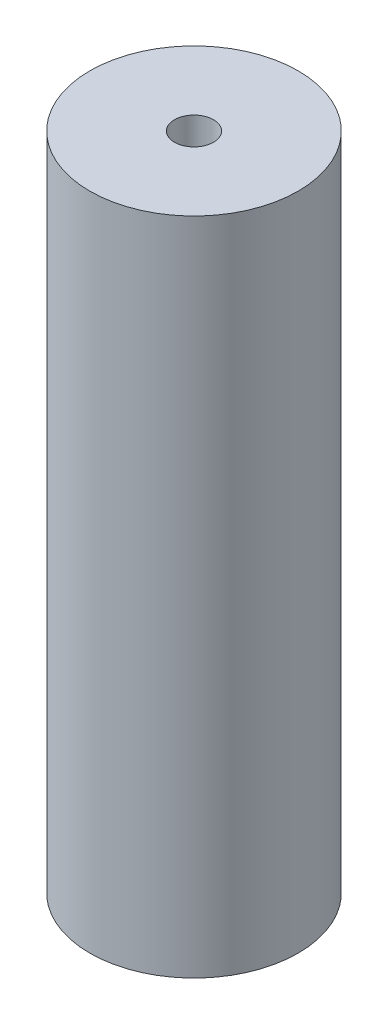
ISO-10303-21;
HEADER;
FILE_DESCRIPTION(('STEP AP214'),'2;1');
FILE_NAME('part.step','',(''),(''),'','','');
FILE_SCHEMA(('AUTOMOTIVE_DESIGN { 1 0 10303 214 1 1 1 1 }'));
ENDSEC;
DATA;
#1=APPLICATION_CONTEXT('core data for automotive mechanical design processes');
#2=APPLICATION_PROTOCOL_DEFINITION('international standard','automotive_design',2000,#1);
#3=PRODUCT_CONTEXT('',#1,'mechanical');
#4=PRODUCT('Part','Part','',(#3));
#5=PRODUCT_RELATED_PRODUCT_CATEGORY('part','',(#4));
#6=PRODUCT_DEFINITION_FORMATION('','',#4);
#7=PRODUCT_DEFINITION_CONTEXT('part definition',#1,'design');
#8=PRODUCT_DEFINITION('design','',#6,#7);
#9=PRODUCT_DEFINITION_SHAPE('','',#8);
#10=(LENGTH_UNIT() NAMED_UNIT(*) SI_UNIT(.MILLI.,.METRE.));
#11=(NAMED_UNIT(*) PLANE_ANGLE_UNIT() SI_UNIT($,.RADIAN.));
#12=(NAMED_UNIT(*) SI_UNIT($,.STERADIAN.) SOLID_ANGLE_UNIT());
#13=UNCERTAINTY_MEASURE_WITH_UNIT(LENGTH_MEASURE(1.E-05),#10,'distance_accuracy_value','');
#14=(GEOMETRIC_REPRESENTATION_CONTEXT(3) GLOBAL_UNCERTAINTY_ASSIGNED_CONTEXT((#13)) GLOBAL_UNIT_ASSIGNED_CONTEXT((#10,
#11,#12)) REPRESENTATION_CONTEXT('',''));
#15=CARTESIAN_POINT('',(0.,0.,0.));
#16=DIRECTION('',(0.,0.,1.));
#17=DIRECTION('',(1.,0.,0.));
#18=AXIS2_PLACEMENT_3D('',#15,#16,#17);
#19=CARTESIAN_POINT('',(0.,38.,0.));
#20=DIRECTION('',(0.,-1.,0.));
#21=DIRECTION('',(0.,0.,-1.));
#22=AXIS2_PLACEMENT_3D('',#19,#20,#21);
#23=CYLINDRICAL_SURFACE('',#22,6.);
#24=CARTESIAN_POINT('',(0.,38.,0.));
#25=DIRECTION('',(0.,1.,0.));
#26=DIRECTION('',(0.,0.,1.));
#27=AXIS2_PLACEMENT_3D('',#24,#25,#26);
#28=CIRCLE('',#27,6.);
#29=CARTESIAN_POINT('',(0.,38.,6.));
#30=VERTEX_POINT('',#29);
#31=EDGE_CURVE('E11',#30,#30,#28,.T.);
#32=ORIENTED_EDGE('',*,*,#31,.F.);
#33=EDGE_LOOP('',(#32));
#34=FACE_BOUND('',#33,.T.);
#35=CARTESIAN_POINT('',(0.,0.,0.));
#36=DIRECTION('',(0.,1.,0.));
#37=DIRECTION('',(0.,0.,1.));
#38=AXIS2_PLACEMENT_3D('',#35,#36,#37);
#39=CIRCLE('',#38,6.);
#40=CARTESIAN_POINT('',(0.,0.,6.));
#41=VERTEX_POINT('',#40);
#42=EDGE_CURVE('E44',#41,#41,#39,.T.);
#43=ORIENTED_EDGE('',*,*,#42,.T.);
#44=EDGE_LOOP('',(#43));
#45=FACE_BOUND('',#44,.T.);
#46=ADVANCED_FACE('F37',(#34,#45),#23,.T.);
#47=CARTESIAN_POINT('',(0.,38.,0.));
#48=DIRECTION('',(0.,1.,0.));
#49=DIRECTION('',(0.,0.,1.));
#50=AXIS2_PLACEMENT_3D('',#47,#48,#49);
#51=PLANE('',#50);
#52=CARTESIAN_POINT('',(0.,38.,0.));
#53=DIRECTION('',(0.,-1.,0.));
#54=DIRECTION('',(0.,0.,-1.));
#55=AXIS2_PLACEMENT_3D('',#52,#53,#54);
#56=CIRCLE('',#55,1.125);
#57=CARTESIAN_POINT('',(0.,38.,-1.125));
#58=VERTEX_POINT('',#57);
#59=EDGE_CURVE('E49',#58,#58,#56,.T.);
#60=ORIENTED_EDGE('',*,*,#59,.T.);
#61=EDGE_LOOP('',(#60));
#62=FACE_BOUND('',#61,.T.);
#63=ORIENTED_EDGE('',*,*,#31,.T.);
#64=EDGE_LOOP('',(#63));
#65=FACE_BOUND('',#64,.T.);
#66=ADVANCED_FACE('F67',(#62,#65),#51,.T.);
#67=CARTESIAN_POINT('',(0.,0.,0.));
#68=DIRECTION('',(0.,1.,0.));
#69=DIRECTION('',(0.,0.,1.));
#70=AXIS2_PLACEMENT_3D('',#67,#68,#69);
#71=PLANE('',#70);
#72=CARTESIAN_POINT('',(0.,0.,0.));
#73=DIRECTION('',(0.,-1.,0.));
#74=DIRECTION('',(0.,0.,-1.));
#75=AXIS2_PLACEMENT_3D('',#72,#73,#74);
#76=CIRCLE('',#75,2.75);
#77=CARTESIAN_POINT('',(0.,0.,-2.75));
#78=VERTEX_POINT('',#77);
#79=EDGE_CURVE('E56',#78,#78,#76,.T.);
#80=ORIENTED_EDGE('',*,*,#79,.F.);
#81=EDGE_LOOP('',(#80));
#82=FACE_BOUND('',#81,.T.);
#83=ORIENTED_EDGE('',*,*,#42,.F.);
#84=EDGE_LOOP('',(#83));
#85=FACE_BOUND('',#84,.T.);
#86=ADVANCED_FACE('F63',(#82,#85),#71,.F.);
#87=CARTESIAN_POINT('',(0.,38.,0.));
#88=DIRECTION('',(0.,-1.,0.));
#89=DIRECTION('',(0.,0.,-1.));
#90=AXIS2_PLACEMENT_3D('',#87,#88,#89);
#91=CYLINDRICAL_SURFACE('',#90,1.125);
#92=CARTESIAN_POINT('',(0.,21.,0.));
#93=DIRECTION('',(0.,1.,0.));
#94=DIRECTION('',(0.,0.,1.));
#95=AXIS2_PLACEMENT_3D('',#92,#93,#94);
#96=CIRCLE('',#95,1.125);
#97=CARTESIAN_POINT('',(0.,21.,1.125));
#98=VERTEX_POINT('',#97);
#99=EDGE_CURVE('E40',#98,#98,#96,.F.);
#100=ORIENTED_EDGE('',*,*,#99,.T.);
#101=EDGE_LOOP('',(#100));
#102=FACE_BOUND('',#101,.T.);
#103=ORIENTED_EDGE('',*,*,#59,.F.);
#104=EDGE_LOOP('',(#103));
#105=FACE_BOUND('',#104,.T.);
#106=ADVANCED_FACE('F66',(#102,#105),#91,.F.);
#107=CARTESIAN_POINT('',(0.,21.,0.));
#108=DIRECTION('',(0.,1.,0.));
#109=DIRECTION('',(0.,0.,1.));
#110=AXIS2_PLACEMENT_3D('',#107,#108,#109);
#111=PLANE('',#110);
#112=CARTESIAN_POINT('',(0.,21.,0.));
#113=DIRECTION('',(0.,1.,0.));
#114=DIRECTION('',(0.,0.,1.));
#115=AXIS2_PLACEMENT_3D('',#112,#113,#114);
#116=CIRCLE('',#115,2.75);
#117=CARTESIAN_POINT('',(0.,21.,2.75));
#118=VERTEX_POINT('',#117);
#119=EDGE_CURVE('E53',#118,#118,#116,.F.);
#120=ORIENTED_EDGE('',*,*,#119,.T.);
#121=EDGE_LOOP('',(#120));
#122=FACE_BOUND('',#121,.T.);
#123=ORIENTED_EDGE('',*,*,#99,.F.);
#124=EDGE_LOOP('',(#123));
#125=FACE_BOUND('',#124,.T.);
#126=ADVANCED_FACE('F82',(#122,#125),#111,.F.);
#127=CARTESIAN_POINT('',(0.,45.778174593052,0.));
#128=DIRECTION('',(0.,-1.,0.));
#129=DIRECTION('',(0.,0.,-1.));
#130=AXIS2_PLACEMENT_3D('',#127,#128,#129);
#131=CYLINDRICAL_SURFACE('',#130,2.75);
#132=ORIENTED_EDGE('',*,*,#79,.T.);
#133=EDGE_LOOP('',(#132));
#134=FACE_BOUND('',#133,.T.);
#135=ORIENTED_EDGE('',*,*,#119,.F.);
#136=EDGE_LOOP('',(#135));
#137=FACE_BOUND('',#136,.T.);
#138=ADVANCED_FACE('F60',(#134,#137),#131,.F.);
#139=CLOSED_SHELL('',(#46,#66,#86,#106,#126,#138));
#140=MANIFOLD_SOLID_BREP('B2',#139);
#141=ADVANCED_BREP_SHAPE_REPRESENTATION('',(#18,#140),#14);
#142=SHAPE_DEFINITION_REPRESENTATION(#9,#141);
ENDSEC;
END-ISO-10303-21;
